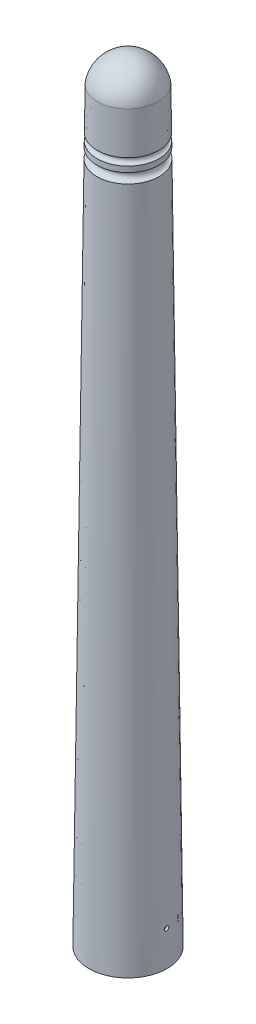
ISO-10303-21;
HEADER;
FILE_DESCRIPTION(('STEP AP214'),'2;1');
FILE_NAME('part.step','',(''),(''),'','','');
FILE_SCHEMA(('AUTOMOTIVE_DESIGN { 1 0 10303 214 1 1 1 1 }'));
ENDSEC;
DATA;
#1=APPLICATION_CONTEXT('core data for automotive mechanical design processes');
#2=APPLICATION_PROTOCOL_DEFINITION('international standard','automotive_design',2000,#1);
#3=PRODUCT_CONTEXT('',#1,'mechanical');
#4=PRODUCT('Part','Part','',(#3));
#5=PRODUCT_RELATED_PRODUCT_CATEGORY('part','',(#4));
#6=PRODUCT_DEFINITION_FORMATION('','',#4);
#7=PRODUCT_DEFINITION_CONTEXT('part definition',#1,'design');
#8=PRODUCT_DEFINITION('design','',#6,#7);
#9=PRODUCT_DEFINITION_SHAPE('','',#8);
#10=(LENGTH_UNIT() NAMED_UNIT(*) SI_UNIT(.MILLI.,.METRE.));
#11=(NAMED_UNIT(*) PLANE_ANGLE_UNIT() SI_UNIT($,.RADIAN.));
#12=(NAMED_UNIT(*) SI_UNIT($,.STERADIAN.) SOLID_ANGLE_UNIT());
#13=UNCERTAINTY_MEASURE_WITH_UNIT(LENGTH_MEASURE(1.E-05),#10,'distance_accuracy_value','');
#14=(GEOMETRIC_REPRESENTATION_CONTEXT(3) GLOBAL_UNCERTAINTY_ASSIGNED_CONTEXT((#13)) GLOBAL_UNIT_ASSIGNED_CONTEXT((#10,
#11,#12)) REPRESENTATION_CONTEXT('',''));
#15=CARTESIAN_POINT('',(0.,0.,0.));
#16=DIRECTION('',(0.,0.,1.));
#17=DIRECTION('',(1.,0.,0.));
#18=AXIS2_PLACEMENT_3D('',#15,#16,#17);
#19=CARTESIAN_POINT('',(0.,-7.44450006252023,0.));
#20=DIRECTION('',(0.,-1.,0.));
#21=DIRECTION('',(0.,0.,-1.));
#22=AXIS2_PLACEMENT_3D('',#19,#20,#21);
#23=CONICAL_SURFACE('',#22,3.58656395421535,0.0116273829563839);
#24=CARTESIAN_POINT('',(4.45186521809091,-82.1763548155042,-0.180897609087725));
#25=CARTESIAN_POINT('',(4.45133696254806,-82.1662011949109,-0.190989953589884));
#26=CARTESIAN_POINT('',(4.4507987971838,-82.1551884002927,-0.200231741131268));
#27=CARTESIAN_POINT('',(4.44975263585336,-82.1317572640246,-0.216742695208402));
#28=CARTESIAN_POINT('',(4.44924467581587,-82.1193372976227,-0.224009547865031));
#29=CARTESIAN_POINT('',(4.44830472649053,-82.0934546858932,-0.236352260465009));
#30=CARTESIAN_POINT('',(4.44787270634149,-82.079992467345,-0.241429011668359));
#31=CARTESIAN_POINT('',(4.44712015789734,-82.0524072639005,-0.249248258931501));
#32=CARTESIAN_POINT('',(4.44679960183886,-82.0382844445419,-0.251991336507259));
#33=CARTESIAN_POINT('',(4.44629246369156,-82.0097900041909,-0.255065505293527));
#34=CARTESIAN_POINT('',(4.44610575304939,-81.9954186355474,-0.255398913701688));
#35=CARTESIAN_POINT('',(4.44587279587092,-81.9668219978596,-0.253650163557854));
#36=CARTESIAN_POINT('',(4.44582655416494,-81.9525967338562,-0.251567921942202));
#37=CARTESIAN_POINT('',(4.44586577056099,-81.9247067686197,-0.245049768496124));
#38=CARTESIAN_POINT('',(4.44595113765947,-81.9110416867433,-0.240615484423253));
#39=CARTESIAN_POINT('',(4.44623035818577,-81.8846485148571,-0.229520755896661));
#40=CARTESIAN_POINT('',(4.44642421222358,-81.8719204301162,-0.222860298925791));
#41=CARTESIAN_POINT('',(4.44688637109678,-81.8477471397306,-0.207493552654837));
#42=CARTESIAN_POINT('',(4.44715475945235,-81.8363033935824,-0.198784969992865));
#43=CARTESIAN_POINT('',(4.44772444841372,-81.8150387558507,-0.179572531445985));
#44=CARTESIAN_POINT('',(4.44802574922283,-81.8052178742928,-0.169068664471128));
#45=CARTESIAN_POINT('',(4.44861809367516,-81.7874665301869,-0.146549051821834));
#46=CARTESIAN_POINT('',(4.44890912493498,-81.779538287648,-0.134531555689567));
#47=CARTESIAN_POINT('',(4.4494399611415,-81.765812830889,-0.109334596551523));
#48=CARTESIAN_POINT('',(4.44967976625599,-81.7600156096884,-0.0961551373520675));
#49=CARTESIAN_POINT('',(4.45007527943269,-81.750720928373,-0.0690165100517572));
#50=CARTESIAN_POINT('',(4.45023103864346,-81.7472220692407,-0.0550578218944583));
#51=CARTESIAN_POINT('',(4.45043767448325,-81.7426190535488,-0.0267503292263176));
#52=CARTESIAN_POINT('',(4.4504885521797,-81.7415148726169,-0.0124015286874214));
#53=CARTESIAN_POINT('',(4.45047860906521,-81.7417328014188,0.0162569639966399));
#54=CARTESIAN_POINT('',(4.45041794805319,-81.7430514400333,0.0305666827219001));
#55=CARTESIAN_POINT('',(4.45019336320202,-81.7480702979175,0.0587613043160999));
#56=CARTESIAN_POINT('',(4.45002943935078,-81.7517705174666,0.0726462071351982));
#57=CARTESIAN_POINT('',(4.449620393878,-81.7614464457621,0.0995973920196998));
#58=CARTESIAN_POINT('',(4.44937527399494,-81.7674221057902,0.112663691604868));
#59=CARTESIAN_POINT('',(4.44883722068528,-81.7814786974791,0.137608961360955));
#60=CARTESIAN_POINT('',(4.44854428679704,-81.7895596494665,0.149487920066609));
#61=CARTESIAN_POINT('',(4.44795097477862,-81.8076106802943,0.171739399712392));
#62=CARTESIAN_POINT('',(4.44765058665499,-81.8175834291537,0.182109754460517));
#63=CARTESIAN_POINT('',(4.44708637604421,-81.8391281292797,0.20103068644243));
#64=CARTESIAN_POINT('',(4.4468225537191,-81.8507000876328,0.209581255611992));
#65=CARTESIAN_POINT('',(4.44637243669235,-81.8751237486263,0.224625116411771));
#66=CARTESIAN_POINT('',(4.44618619258946,-81.8879762797433,0.231117064693609));
#67=CARTESIAN_POINT('',(4.44592520601083,-81.9145899605015,0.241850837673153));
#68=CARTESIAN_POINT('',(4.44585046263495,-81.9283511028066,0.246092680535934));
#69=CARTESIAN_POINT('',(4.44583452398594,-81.9563745017016,0.252201202928938));
#70=CARTESIAN_POINT('',(4.44589317676826,-81.9706361699482,0.254070581029875));
#71=CARTESIAN_POINT('',(4.446151116941,-81.99926964635,0.255389372288031));
#72=CARTESIAN_POINT('',(4.44635040329469,-82.0136414536924,0.254838803284806));
#73=CARTESIAN_POINT('',(4.44688087652069,-82.0420698629955,0.251335604492354));
#74=CARTESIAN_POINT('',(4.44721191139928,-82.0561268085306,0.248385738610483));
#75=CARTESIAN_POINT('',(4.44798230531966,-82.0835443253895,0.240171877679217));
#76=CARTESIAN_POINT('',(4.44842166473214,-82.0969048943301,0.234907874710994));
#77=CARTESIAN_POINT('',(4.44937260370939,-82.1225603798353,0.22221159123739));
#78=CARTESIAN_POINT('',(4.44988422890421,-82.1348546151179,0.214777937584781));
#79=CARTESIAN_POINT('',(4.45093395682327,-82.1580213628811,0.197954396282711));
#80=CARTESIAN_POINT('',(4.45147205985053,-82.1688938590851,0.188564486240602));
#81=CARTESIAN_POINT('',(4.4525256773958,-82.1889250780117,0.168079008126258));
#82=CARTESIAN_POINT('',(4.45304115859921,-82.1980813341211,0.156981026241696));
#83=CARTESIAN_POINT('',(4.45399965848312,-82.2144017183676,0.133403087604571));
#84=CARTESIAN_POINT('',(4.45444267703565,-82.2215658429865,0.120923128411511));
#85=CARTESIAN_POINT('',(4.45521339131535,-82.2336985036724,0.0949344356724136));
#86=CARTESIAN_POINT('',(4.45554108535132,-82.2386670075416,0.0814256870430928));
#87=CARTESIAN_POINT('',(4.45604905798949,-82.2462661279643,0.0537637951067203));
#88=CARTESIAN_POINT('',(4.45622934361983,-82.2488968559789,0.0396106825556372));
#89=CARTESIAN_POINT('',(4.45642462169087,-82.2517432738487,0.0110844672769701));
#90=CARTESIAN_POINT('',(4.45643986589014,-82.2519626420638,-0.00328826688186547));
#91=CARTESIAN_POINT('',(4.45630418129406,-82.2499890730905,-0.0318700986156532));
#92=CARTESIAN_POINT('',(4.45615321326153,-82.2477955663027,-0.0460791567518661));
#93=CARTESIAN_POINT('',(4.45569999417235,-82.2410598263617,-0.0739227467420194));
#94=CARTESIAN_POINT('',(4.45539776777433,-82.2365179760391,-0.0875573718492295));
#95=CARTESIAN_POINT('',(4.45467174328047,-82.2252175479031,-0.113858338779414));
#96=CARTESIAN_POINT('',(4.45424808604593,-82.218461537249,-0.126525781108769));
#97=CARTESIAN_POINT('',(4.45348901545949,-82.2057529341842,-0.146180442841628));
#98=CARTESIAN_POINT('',(4.45317731123523,-82.2003973771107,-0.153561740512666));
#99=CARTESIAN_POINT('',(4.45253348154765,-82.1889287788009,-0.167709358961442));
#100=CARTESIAN_POINT('',(4.45220135605911,-82.1828157366292,-0.174475678979614));
#101=CARTESIAN_POINT('',(4.45186521809091,-82.1763548155042,-0.180897609087725));
#102=B_SPLINE_CURVE_WITH_KNOTS('',3,(#24,#25,#26,#27,#28,#29,#30,#31,#32,#33,#34,#35,#36,#37,
#38,#39,#40,#41,#42,#43,#44,#45,#46,#47,#48,#49,#50,#51,#52,#53,#54,#55,#56,#57,#58,#59,#60,#61,
#62,#63,#64,#65,#66,#67,#68,#69,#70,#71,#72,#73,#74,#75,#76,#77,#78,#79,#80,#81,#82,#83,#84,#85,
#86,#87,#88,#89,#90,#91,#92,#93,#94,#95,#96,#97,#98,#99,#100,#101),.UNSPECIFIED.,.T.,.F.,(4,2,2,
2,2,2,2,2,2,2,2,2,2,2,2,2,2,2,2,2,2,2,2,2,2,2,2,2,2,2,2,2,2,2,2,2,2,2,4),(0.,0.0429444089041082,
0.085938917655628,0.128915913283914,0.17188219655935,0.214807156886697,0.257733593259763,
0.300630360594177,0.343527369129221,0.386472641660441,0.429418179485588,0.472413846316885,
0.515409372309563,0.558378702527949,0.601347595416027,0.644254975728852,0.687162361075741,
0.730068827803853,0.772975708807683,0.815943603876871,0.858911689350672,0.901907756125286,
0.944903475787883,0.987850245814929,1.03079669924413,1.07369374978959,1.11659094712714,
1.15951535270206,1.20244024964609,1.2454263738087,1.28841257388363,1.33139940430899,
1.37438418508766,1.41730338648853,1.46023272185817,1.50315506102627,1.5460278098586,
1.57335403240645,1.60068028870471),.UNSPECIFIED.);
#103=CARTESIAN_POINT('',(4.45186521809091,-82.1763548155042,-0.180897609087725));
#104=VERTEX_POINT('',#103);
#105=EDGE_CURVE('E10',#104,#104,#102,.T.);
#106=ORIENTED_EDGE('',*,*,#105,.F.);
#107=EDGE_LOOP('',(#106));
#108=FACE_BOUND('',#107,.T.);
#109=CARTESIAN_POINT('',(-4.45186521809091,-82.1763548155042,-0.180897609087725));
#110=CARTESIAN_POINT('',(-4.45239347447425,-82.1865077634648,-0.170804181228594));
#111=CARTESIAN_POINT('',(-4.45291253086919,-82.195815763032,-0.159845987335075));
#112=CARTESIAN_POINT('',(-4.45388268766662,-82.2124688878007,-0.136511681014895));
#113=CARTESIAN_POINT('',(-4.45433370805621,-82.2198117096127,-0.124133928774057));
#114=CARTESIAN_POINT('',(-4.45512353842167,-82.2323142525421,-0.0983224733336757));
#115=CARTESIAN_POINT('',(-4.45546239412044,-82.2374748634566,-0.0848892031764814));
#116=CARTESIAN_POINT('',(-4.45599489640195,-82.2454676268726,-0.0573480544334409));
#117=CARTESIAN_POINT('',(-4.45618857916141,-82.2483003594924,-0.0432403448489899));
#118=CARTESIAN_POINT('',(-4.45641172795,-82.251557175688,-0.0147618727615466));
#119=CARTESIAN_POINT('',(-4.45644135036041,-82.2519835529936,-0.000391373864488743));
#120=CARTESIAN_POINT('',(-4.45633387508719,-82.2504214634613,0.0282176178043883));
#121=CARTESIAN_POINT('',(-4.4561967717026,-82.248432914048,0.0424561060454942));
#122=CARTESIAN_POINT('',(-4.45576947845348,-82.242100092925,0.070385930722042));
#123=CARTESIAN_POINT('',(-4.45547939848003,-82.2377575121765,0.0840776523433301));
#124=CARTESIAN_POINT('',(-4.45477455221765,-82.2268414187198,0.110537341320592));
#125=CARTESIAN_POINT('',(-4.45435978525637,-82.2202678939817,0.123305303694858));
#126=CARTESIAN_POINT('',(-4.45344517033856,-82.2050678121157,0.147570435500507));
#127=CARTESIAN_POINT('',(-4.45294522975885,-82.1964390158449,0.159066198770628));
#128=CARTESIAN_POINT('',(-4.45190830941517,-82.1773761090541,0.180446319545611));
#129=CARTESIAN_POINT('',(-4.45137132941597,-82.1669419870678,0.190330666814979));
#130=CARTESIAN_POINT('',(-4.45030984641402,-82.144549300965,0.208219301086236));
#131=CARTESIAN_POINT('',(-4.4497853589781,-82.1325889420318,0.216221342523128));
#132=CARTESIAN_POINT('',(-4.44879696426268,-82.1074917260065,0.230102776824502));
#133=CARTESIAN_POINT('',(-4.44833305680056,-82.094354872461,0.235982176087649));
#134=CARTESIAN_POINT('',(-4.44750559895687,-82.0672848025505,0.245447719482092));
#135=CARTESIAN_POINT('',(-4.44714199151447,-82.0533520444456,0.249035169042391));
#136=CARTESIAN_POINT('',(-4.44654224052927,-82.0250793115672,0.253819209888089));
#137=CARTESIAN_POINT('',(-4.44630609567578,-82.0107393409827,0.255015825758937));
#138=CARTESIAN_POINT('',(-4.4459741457576,-81.9820812473672,0.254983880277584));
#139=CARTESIAN_POINT('',(-4.44587813879476,-81.9677631226527,0.253758813875738));
#140=CARTESIAN_POINT('',(-4.44582259740089,-81.9395346746867,0.248925640490905));
#141=CARTESIAN_POINT('',(-4.44586306295212,-81.9256243513822,0.245317533817655));
#142=CARTESIAN_POINT('',(-4.44606222416919,-81.8986068418849,0.235821752818788));
#143=CARTESIAN_POINT('',(-4.44622091247022,-81.8854996057181,0.229934220503145));
#144=CARTESIAN_POINT('',(-4.44662576710865,-81.8604578449982,0.216047015776403));
#145=CARTESIAN_POINT('',(-4.4468719342866,-81.8485233317146,0.208047323070633));
#146=CARTESIAN_POINT('',(-4.44741275374897,-81.8261480523815,0.19014945887472));
#147=CARTESIAN_POINT('',(-4.44770747418002,-81.8157094249373,0.180248615755611));
#148=CARTESIAN_POINT('',(-4.44830172011535,-81.7966415236159,0.158835769068303));
#149=CARTESIAN_POINT('',(-4.44860124564191,-81.7880122581361,0.147323758022988));
#150=CARTESIAN_POINT('',(-4.44916311123158,-81.7728028448804,0.123005545672801));
#151=CARTESIAN_POINT('',(-4.44942542568358,-81.766224104718,0.110198463299685));
#152=CARTESIAN_POINT('',(-4.44987657257279,-81.7553117992289,0.0836598528403487));
#153=CARTESIAN_POINT('',(-4.45006540558819,-81.750978216236,0.0699283320291081));
#154=CARTESIAN_POINT('',(-4.45034385819239,-81.7446841330812,0.0419468511727907));
#155=CARTESIAN_POINT('',(-4.45043358795658,-81.7427209974111,0.0276974850760652));
#156=CARTESIAN_POINT('',(-4.4505021659124,-81.7412155137727,-0.000928774069362155));
#157=CARTESIAN_POINT('',(-4.45048101493857,-81.741673147585,-0.0153056661574504));
#158=CARTESIAN_POINT('',(-4.45033075806717,-81.7449940137588,-0.0437611105368845));
#159=CARTESIAN_POINT('',(-4.45020177864586,-81.7478544278229,-0.0578399925484791));
#160=CARTESIAN_POINT('',(-4.44985333788877,-81.7558951317617,-0.0853176970882486));
#161=CARTESIAN_POINT('',(-4.44963387626957,-81.7610754289032,-0.0987165174861071));
#162=CARTESIAN_POINT('',(-4.44913404504293,-81.7736118244352,-0.124462927929423));
#163=CARTESIAN_POINT('',(-4.44885363927075,-81.7809692156719,-0.136809887710793));
#164=CARTESIAN_POINT('',(-4.44827070626558,-81.7976496641133,-0.160095228681383));
#165=CARTESIAN_POINT('',(-4.44796817877748,-81.8069727439881,-0.171033593623124));
#166=CARTESIAN_POINT('',(-4.447383700911,-81.8273354503596,-0.191207634864162));
#167=CARTESIAN_POINT('',(-4.44710178065898,-81.8383775189513,-0.200440847282852));
#168=CARTESIAN_POINT('',(-4.44660163681343,-81.8618557833607,-0.216923527456785));
#169=CARTESIAN_POINT('',(-4.44638341335063,-81.8742919820395,-0.224172991140543));
#170=CARTESIAN_POINT('',(-4.44604753967127,-81.9002067827356,-0.236482241823014));
#171=CARTESIAN_POINT('',(-4.44592989514673,-81.9136854437014,-0.241541904886937));
#172=CARTESIAN_POINT('',(-4.44582180720465,-81.9413009497445,-0.249325955473948));
#173=CARTESIAN_POINT('',(-4.4458313577189,-81.9554377633906,-0.252050454396208));
#174=CARTESIAN_POINT('',(-4.44599037516991,-81.9839455480441,-0.255084053168766));
#175=CARTESIAN_POINT('',(-4.44613962900999,-81.9983161296752,-0.255396825039469));
#176=CARTESIAN_POINT('',(-4.44657506341642,-82.0269077501507,-0.253607158960876));
#177=CARTESIAN_POINT('',(-4.44686127627737,-82.041128752916,-0.251504151212556));
#178=CARTESIAN_POINT('',(-4.44755210587335,-82.0690095456929,-0.244944119452395));
#179=CARTESIAN_POINT('',(-4.4479566990037,-82.0826694469678,-0.240487564588721));
#180=CARTESIAN_POINT('',(-4.44885179745963,-82.1090343099354,-0.22935027252603));
#181=CARTESIAN_POINT('',(-4.44934220297461,-82.1217403568102,-0.222672111291));
#182=CARTESIAN_POINT('',(-4.45017998248183,-82.1414678210293,-0.210083765340395));
#183=CARTESIAN_POINT('',(-4.45051472637494,-82.1488796537199,-0.20477344423727));
#184=CARTESIAN_POINT('',(-4.45118929427528,-82.1630932766746,-0.193391306573403));
#185=CARTESIAN_POINT('',(-4.45152911828863,-82.1698950662049,-0.187319489096681));
#186=CARTESIAN_POINT('',(-4.45186521809091,-82.1763548155042,-0.180897609087725));
#187=B_SPLINE_CURVE_WITH_KNOTS('',3,(#109,#110,#111,#112,#113,#114,#115,#116,#117,#118,#119,
#120,#121,#122,#123,#124,#125,#126,#127,#128,#129,#130,#131,#132,#133,#134,#135,#136,#137,#138,
#139,#140,#141,#142,#143,#144,#145,#146,#147,#148,#149,#150,#151,#152,#153,#154,#155,#156,#157,
#158,#159,#160,#161,#162,#163,#164,#165,#166,#167,#168,#169,#170,#171,#172,#173,#174,#175,#176,
#177,#178,#179,#180,#181,#182,#183,#184,#185,#186),.UNSPECIFIED.,.T.,.F.,(4,2,2,2,2,2,2,2,2,2,2,
2,2,2,2,2,2,2,2,2,2,2,2,2,2,2,2,2,2,2,2,2,2,2,2,2,2,2,4),(0.,0.0429452706508746,
0.0859406592682368,0.128918499559743,0.171885626319088,0.214811790031328,0.257739421590978,
0.300636257914158,0.343533325556829,0.386477343486969,0.429421634180968,0.472416899899624,
0.515412036008774,0.558382661434354,0.601352844981611,0.644261059615585,0.687169268672542,
0.730074804945079,0.772980753489982,0.81594744365655,0.858914333229795,0.901910653429853,
0.944906635304713,0.987854769285007,1.03080258002463,1.07370008613452,1.11659772661404,
1.1595208927377,1.20244455391555,1.24542976098768,1.28841505628281,1.33140278407204,
1.37438846101451,1.41730867635742,1.4602390171766,1.50316080363431,1.54603299452492,
1.57335662007418,1.60068027849044),.UNSPECIFIED.);
#188=CARTESIAN_POINT('',(-4.45186521809091,-82.1763548155042,-0.180897609087725));
#189=VERTEX_POINT('',#188);
#190=EDGE_CURVE('E44',#189,#189,#187,.T.);
#191=ORIENTED_EDGE('',*,*,#190,.F.);
#192=EDGE_LOOP('',(#191));
#193=FACE_BOUND('',#192,.T.);
#194=CARTESIAN_POINT('',(0.,-86.,0.));
#195=DIRECTION('',(0.,1.,0.));
#196=DIRECTION('',(0.,0.,1.));
#197=AXIS2_PLACEMENT_3D('',#194,#195,#196);
#198=CIRCLE('',#197,4.5);
#199=CARTESIAN_POINT('',(0.,-86.,4.5));
#200=VERTEX_POINT('',#199);
#201=EDGE_CURVE('E48',#200,#200,#198,.T.);
#202=ORIENTED_EDGE('',*,*,#201,.T.);
#203=EDGE_LOOP('',(#202));
#204=FACE_BOUND('',#203,.T.);
#205=CARTESIAN_POINT('',(0.,-7.44450006252023,0.));
#206=DIRECTION('',(0.,1.,0.));
#207=DIRECTION('',(0.,0.,1.));
#208=AXIS2_PLACEMENT_3D('',#205,#206,#207);
#209=CIRCLE('',#208,3.58656395421535);
#210=CARTESIAN_POINT('',(0.,-7.44450006252023,3.58656395421535));
#211=VERTEX_POINT('',#210);
#212=EDGE_CURVE('E113',#211,#211,#209,.T.);
#213=ORIENTED_EDGE('',*,*,#212,.F.);
#214=EDGE_LOOP('',(#213));
#215=FACE_BOUND('',#214,.T.);
#216=ADVANCED_FACE('F33',(#108,#193,#204,#215),#23,.T.);
#217=CARTESIAN_POINT('',(4.5,-86.,0.));
#218=DIRECTION('',(0.,-1.,0.));
#219=DIRECTION('',(0.,0.,-1.));
#220=AXIS2_PLACEMENT_3D('',#217,#218,#219);
#221=PLANE('',#220);
#222=ORIENTED_EDGE('',*,*,#201,.F.);
#223=EDGE_LOOP('',(#222));
#224=FACE_BOUND('',#223,.T.);
#225=ADVANCED_FACE('F100',(#224),#221,.T.);
#226=CARTESIAN_POINT('',(0.,-0.541666666666667,0.));
#227=DIRECTION('',(0.,1.,0.));
#228=DIRECTION('',(-1.,0.,0.));
#229=AXIS2_PLACEMENT_3D('',#226,#227,#228);
#230=SPHERICAL_SURFACE('',#229,3.54166666666667);
#231=CARTESIAN_POINT('',(0.,0.,0.));
#232=DIRECTION('',(0.,1.,0.));
#233=DIRECTION('',(0.,0.,1.));
#234=AXIS2_PLACEMENT_3D('',#231,#232,#233);
#235=CIRCLE('',#234,3.5);
#236=CARTESIAN_POINT('',(0.,0.,3.5));
#237=VERTEX_POINT('',#236);
#238=EDGE_CURVE('E52',#237,#237,#235,.T.);
#239=ORIENTED_EDGE('',*,*,#238,.T.);
#240=EDGE_LOOP('',(#239));
#241=FACE_BOUND('',#240,.T.);
#242=ADVANCED_FACE('F97',(#241),#230,.T.);
#243=CARTESIAN_POINT('',(0.,0.,0.));
#244=DIRECTION('',(0.,-1.,0.));
#245=DIRECTION('',(0.,0.,-1.));
#246=AXIS2_PLACEMENT_3D('',#243,#244,#245);
#247=CONICAL_SURFACE('',#246,3.5,0.0116273829563844);
#248=CARTESIAN_POINT('',(0.,-4.83698773769178,0.));
#249=DIRECTION('',(0.,1.,0.));
#250=DIRECTION('',(0.,0.,1.));
#251=AXIS2_PLACEMENT_3D('',#248,#249,#250);
#252=CIRCLE('',#251,3.55624404346154);
#253=CARTESIAN_POINT('',(0.,-4.83698773769178,3.55624404346154));
#254=VERTEX_POINT('',#253);
#255=EDGE_CURVE('E127',#254,#254,#252,.T.);
#256=ORIENTED_EDGE('',*,*,#255,.T.);
#257=EDGE_LOOP('',(#256));
#258=FACE_BOUND('',#257,.T.);
#259=ORIENTED_EDGE('',*,*,#238,.F.);
#260=EDGE_LOOP('',(#259));
#261=FACE_BOUND('',#260,.T.);
#262=ADVANCED_FACE('F93',(#258,#261),#247,.T.);
#263=CARTESIAN_POINT('',(0.,-5.2512383455165,0.));
#264=DIRECTION('',(0.,1.,0.));
#265=DIRECTION('',(0.,0.,1.));
#266=AXIS2_PLACEMENT_3D('',#263,#264,#265);
#267=TOROIDAL_SURFACE('',#266,3.56106091099438,0.414278611921949);
#268=CARTESIAN_POINT('',(0.,-5.66548895334122,0.));
#269=DIRECTION('',(0.,1.,0.));
#270=DIRECTION('',(0.,0.,1.));
#271=AXIS2_PLACEMENT_3D('',#268,#269,#270);
#272=CIRCLE('',#271,3.56587777852722);
#273=CARTESIAN_POINT('',(0.,-5.66548895334122,3.56587777852722));
#274=VERTEX_POINT('',#273);
#275=EDGE_CURVE('E118',#274,#274,#272,.T.);
#276=ORIENTED_EDGE('',*,*,#275,.T.);
#277=EDGE_LOOP('',(#276));
#278=FACE_BOUND('',#277,.T.);
#279=ORIENTED_EDGE('',*,*,#255,.F.);
#280=EDGE_LOOP('',(#279));
#281=FACE_BOUND('',#280,.T.);
#282=ADVANCED_FACE('F89',(#278,#281),#267,.F.);
#283=CARTESIAN_POINT('',(0.,-5.66548895334122,0.));
#284=DIRECTION('',(0.,-1.,0.));
#285=DIRECTION('',(0.,0.,-1.));
#286=AXIS2_PLACEMENT_3D('',#283,#284,#285);
#287=CONICAL_SURFACE('',#286,3.56587777852722,0.0116273829563843);
#288=CARTESIAN_POINT('',(0.,-6.30807659439742,0.));
#289=DIRECTION('',(0.,1.,0.));
#290=DIRECTION('',(0.,0.,1.));
#291=AXIS2_PLACEMENT_3D('',#288,#289,#290);
#292=CIRCLE('',#291,3.57334972784183);
#293=CARTESIAN_POINT('',(0.,-6.30807659439742,3.57334972784183));
#294=VERTEX_POINT('',#293);
#295=EDGE_CURVE('E114',#294,#294,#292,.T.);
#296=ORIENTED_EDGE('',*,*,#295,.T.);
#297=EDGE_LOOP('',(#296));
#298=FACE_BOUND('',#297,.T.);
#299=ORIENTED_EDGE('',*,*,#275,.F.);
#300=EDGE_LOOP('',(#299));
#301=FACE_BOUND('',#300,.T.);
#302=ADVANCED_FACE('F85',(#298,#301),#287,.T.);
#303=CARTESIAN_POINT('',(0.,-6.87650804857551,0.));
#304=DIRECTION('',(0.,1.,0.));
#305=DIRECTION('',(0.,0.,1.));
#306=AXIS2_PLACEMENT_3D('',#303,#304,#305);
#307=TOROIDAL_SURFACE('',#306,3.56106091099438,0.568564273515763);
#308=ORIENTED_EDGE('',*,*,#212,.T.);
#309=EDGE_LOOP('',(#308));
#310=FACE_BOUND('',#309,.T.);
#311=ORIENTED_EDGE('',*,*,#295,.F.);
#312=EDGE_LOOP('',(#311));
#313=FACE_BOUND('',#312,.T.);
#314=ADVANCED_FACE('F68',(#310,#313),#307,.F.);
#315=CARTESIAN_POINT('',(-4.15346910835105,-82.0000874452823,0.));
#316=DIRECTION('',(0.999932402744371,-0.0116271209621439,0.));
#317=DIRECTION('',(0.0116271209621439,0.999932402744371,0.));
#318=AXIS2_PLACEMENT_3D('',#315,#316,#317);
#319=PLANE('',#318);
#320=CARTESIAN_POINT('',(-4.15346910835105,-82.0000874452823,0.));
#321=DIRECTION('',(-0.999932402744371,0.0116271209621439,0.));
#322=DIRECTION('',(-0.0116271209621439,-0.999932402744371,0.));
#323=AXIS2_PLACEMENT_3D('',#320,#321,#322);
#324=CIRCLE('',#323,0.255000000000014);
#325=CARTESIAN_POINT('',(-4.1564340241964,-82.2550702079822,0.));
#326=VERTEX_POINT('',#325);
#327=EDGE_CURVE('E138',#326,#326,#324,.T.);
#328=ORIENTED_EDGE('',*,*,#327,.T.);
#329=EDGE_LOOP('',(#328));
#330=FACE_BOUND('',#329,.T.);
#331=ADVANCED_FACE('F65',(#330),#319,.F.);
#332=CARTESIAN_POINT('',(-4.45344882917435,-81.9965993089937,0.));
#333=DIRECTION('',(-0.999932402744371,0.0116271209621439,0.));
#334=DIRECTION('',(-0.0116271209621439,-0.999932402744371,0.));
#335=AXIS2_PLACEMENT_3D('',#332,#333,#334);
#336=CYLINDRICAL_SURFACE('',#335,0.255000000000014);
#337=ORIENTED_EDGE('',*,*,#190,.T.);
#338=EDGE_LOOP('',(#337));
#339=FACE_BOUND('',#338,.T.);
#340=ORIENTED_EDGE('',*,*,#327,.F.);
#341=EDGE_LOOP('',(#340));
#342=FACE_BOUND('',#341,.T.);
#343=ADVANCED_FACE('F59',(#339,#342),#336,.F.);
#344=CARTESIAN_POINT('',(4.15346910835105,-82.0000874452823,0.));
#345=DIRECTION('',(-0.999932402744371,-0.0116271209621439,0.));
#346=DIRECTION('',(0.0116271209621439,-0.999932402744371,0.));
#347=AXIS2_PLACEMENT_3D('',#344,#345,#346);
#348=PLANE('',#347);
#349=CARTESIAN_POINT('',(4.15346910835105,-82.0000874452823,0.));
#350=DIRECTION('',(0.999932402744371,0.0116271209621439,0.));
#351=DIRECTION('',(-0.0116271209621439,0.999932402744371,0.));
#352=AXIS2_PLACEMENT_3D('',#349,#350,#351);
#353=CIRCLE('',#352,0.255000000000014);
#354=CARTESIAN_POINT('',(4.1505041925057,-81.7451046825825,0.));
#355=VERTEX_POINT('',#354);
#356=EDGE_CURVE('E141',#355,#355,#353,.T.);
#357=ORIENTED_EDGE('',*,*,#356,.T.);
#358=EDGE_LOOP('',(#357));
#359=FACE_BOUND('',#358,.T.);
#360=ADVANCED_FACE('F64',(#359),#348,.F.);
#361=CARTESIAN_POINT('',(4.45344882917435,-81.9965993089937,0.));
#362=DIRECTION('',(0.999932402744371,0.0116271209621439,0.));
#363=DIRECTION('',(-0.0116271209621439,0.999932402744371,0.));
#364=AXIS2_PLACEMENT_3D('',#361,#362,#363);
#365=CYLINDRICAL_SURFACE('',#364,0.255000000000014);
#366=ORIENTED_EDGE('',*,*,#105,.T.);
#367=EDGE_LOOP('',(#366));
#368=FACE_BOUND('',#367,.T.);
#369=ORIENTED_EDGE('',*,*,#356,.F.);
#370=EDGE_LOOP('',(#369));
#371=FACE_BOUND('',#370,.T.);
#372=ADVANCED_FACE('F146',(#368,#371),#365,.F.);
#373=CLOSED_SHELL('',(#216,#225,#242,#262,#282,#302,#314,#331,#343,#360,#372));
#374=CARTESIAN_POINT('',(0.,-0.342651688778131,0.));
#375=DIRECTION('',(0.,-1.,0.));
#376=DIRECTION('',(0.,0.,-1.));
#377=AXIS2_PLACEMENT_3D('',#374,#375,#376);
#378=CONICAL_SURFACE('',#377,0.503781516486785,0.0116273829563821);
#379=CARTESIAN_POINT('',(0.,-78.5,0.));
#380=DIRECTION('',(0.,1.,0.));
#381=DIRECTION('',(0.,0.,1.));
#382=AXIS2_PLACEMENT_3D('',#379,#380,#381);
#383=CIRCLE('',#382,1.41258789219853);
#384=CARTESIAN_POINT('',(0.,-78.5,1.41258789219853));
#385=VERTEX_POINT('',#384);
#386=EDGE_CURVE('E115',#385,#385,#383,.T.);
#387=ORIENTED_EDGE('',*,*,#386,.F.);
#388=EDGE_LOOP('',(#387));
#389=FACE_BOUND('',#388,.T.);
#390=CARTESIAN_POINT('',(0.,-0.342651688778131,0.));
#391=DIRECTION('',(0.,1.,0.));
#392=DIRECTION('',(0.,0.,1.));
#393=AXIS2_PLACEMENT_3D('',#390,#391,#392);
#394=CIRCLE('',#393,0.503781516486785);
#395=CARTESIAN_POINT('',(0.,-0.342651688778131,0.503781516486785));
#396=VERTEX_POINT('',#395);
#397=EDGE_CURVE('E121',#396,#396,#394,.T.);
#398=ORIENTED_EDGE('',*,*,#397,.T.);
#399=EDGE_LOOP('',(#398));
#400=FACE_BOUND('',#399,.T.);
#401=ADVANCED_FACE('F78',(#389,#400),#378,.F.);
#402=CARTESIAN_POINT('',(1.41258789219853,-78.5,0.));
#403=DIRECTION('',(0.,-1.,0.));
#404=DIRECTION('',(0.,0.,-1.));
#405=AXIS2_PLACEMENT_3D('',#402,#403,#404);
#406=PLANE('',#405);
#407=ORIENTED_EDGE('',*,*,#386,.T.);
#408=EDGE_LOOP('',(#407));
#409=FACE_BOUND('',#408,.T.);
#410=ADVANCED_FACE('F73',(#409),#406,.F.);
#411=CARTESIAN_POINT('',(0.,-0.541666666666667,0.));
#412=DIRECTION('',(0.,1.,0.));
#413=DIRECTION('',(-1.,0.,0.));
#414=AXIS2_PLACEMENT_3D('',#411,#412,#413);
#415=SPHERICAL_SURFACE('',#414,0.541666666666593);
#416=ORIENTED_EDGE('',*,*,#397,.F.);
#417=EDGE_LOOP('',(#416));
#418=FACE_BOUND('',#417,.T.);
#419=ADVANCED_FACE('F70',(#418),#415,.F.);
#420=CLOSED_SHELL('',(#401,#410,#419));
#421=ORIENTED_CLOSED_SHELL('',*,#420,.T.);
#422=BREP_WITH_VOIDS('B2',#373,(#421));
#423=ADVANCED_BREP_SHAPE_REPRESENTATION('',(#18,#422),#14);
#424=SHAPE_DEFINITION_REPRESENTATION(#9,#423);
ENDSEC;
END-ISO-10303-21;
